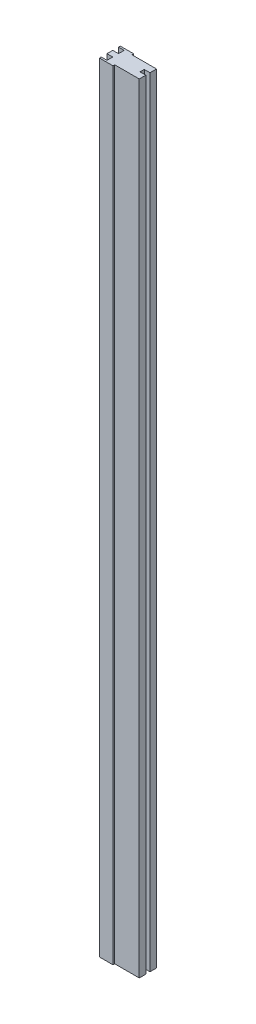
ISO-10303-21;
HEADER;
FILE_DESCRIPTION(('STEP AP214'),'2;1');
FILE_NAME('part.step','',(''),(''),'','','');
FILE_SCHEMA(('AUTOMOTIVE_DESIGN { 1 0 10303 214 1 1 1 1 }'));
ENDSEC;
DATA;
#1=APPLICATION_CONTEXT('core data for automotive mechanical design processes');
#2=APPLICATION_PROTOCOL_DEFINITION('international standard','automotive_design',2000,#1);
#3=PRODUCT_CONTEXT('',#1,'mechanical');
#4=PRODUCT('Part','Part','',(#3));
#5=PRODUCT_RELATED_PRODUCT_CATEGORY('part','',(#4));
#6=PRODUCT_DEFINITION_FORMATION('','',#4);
#7=PRODUCT_DEFINITION_CONTEXT('part definition',#1,'design');
#8=PRODUCT_DEFINITION('design','',#6,#7);
#9=PRODUCT_DEFINITION_SHAPE('','',#8);
#10=(LENGTH_UNIT() NAMED_UNIT(*) SI_UNIT(.MILLI.,.METRE.));
#11=(NAMED_UNIT(*) PLANE_ANGLE_UNIT() SI_UNIT($,.RADIAN.));
#12=(NAMED_UNIT(*) SI_UNIT($,.STERADIAN.) SOLID_ANGLE_UNIT());
#13=UNCERTAINTY_MEASURE_WITH_UNIT(LENGTH_MEASURE(1.E-05),#10,'distance_accuracy_value','');
#14=(GEOMETRIC_REPRESENTATION_CONTEXT(3) GLOBAL_UNCERTAINTY_ASSIGNED_CONTEXT((#13)) GLOBAL_UNIT_ASSIGNED_CONTEXT((#10,
#11,#12)) REPRESENTATION_CONTEXT('',''));
#15=CARTESIAN_POINT('',(0.,0.,0.));
#16=DIRECTION('',(0.,0.,1.));
#17=DIRECTION('',(1.,0.,0.));
#18=AXIS2_PLACEMENT_3D('',#15,#16,#17);
#19=CARTESIAN_POINT('',(3.34276045983517,1350.,-18.));
#20=DIRECTION('',(-1.,0.,0.));
#21=DIRECTION('',(0.,0.,1.));
#22=AXIS2_PLACEMENT_3D('',#19,#20,#21);
#23=PLANE('',#22);
#24=DIRECTION('',(0.,0.,-1.));
#25=VECTOR('',#24,1.);
#26=CARTESIAN_POINT('',(3.34276045983517,0.,-18.));
#27=LINE('',#26,#25);
#28=CARTESIAN_POINT('',(3.34276045983517,0.,-15.));
#29=VERTEX_POINT('',#28);
#30=CARTESIAN_POINT('',(3.34276045983517,0.,-18.));
#31=VERTEX_POINT('',#30);
#32=EDGE_CURVE('E201',#29,#31,#27,.T.);
#33=ORIENTED_EDGE('',*,*,#32,.T.);
#34=DIRECTION('',(0.,-1.,0.));
#35=VECTOR('',#34,1.);
#36=CARTESIAN_POINT('',(3.34276045983517,1350.,-18.));
#37=LINE('',#36,#35);
#38=CARTESIAN_POINT('',(3.34276045983517,1350.,-18.));
#39=VERTEX_POINT('',#38);
#40=EDGE_CURVE('E11',#39,#31,#37,.T.);
#41=ORIENTED_EDGE('',*,*,#40,.F.);
#42=DIRECTION('',(0.,0.,-1.));
#43=VECTOR('',#42,1.);
#44=CARTESIAN_POINT('',(3.34276045983517,1350.,-18.));
#45=LINE('',#44,#43);
#46=CARTESIAN_POINT('',(3.34276045983517,1350.,-15.));
#47=VERTEX_POINT('',#46);
#48=EDGE_CURVE('E240',#47,#39,#45,.T.);
#49=ORIENTED_EDGE('',*,*,#48,.F.);
#50=DIRECTION('',(0.,-1.,0.));
#51=VECTOR('',#50,1.);
#52=CARTESIAN_POINT('',(3.34276045983517,1350.,-15.));
#53=LINE('',#52,#51);
#54=EDGE_CURVE('E197',#47,#29,#53,.T.);
#55=ORIENTED_EDGE('',*,*,#54,.T.);
#56=EDGE_LOOP('',(#33,#41,#49,#55));
#57=FACE_BOUND('',#56,.T.);
#58=ADVANCED_FACE('F33',(#57),#23,.F.);
#59=CARTESIAN_POINT('',(-20.,1350.,-18.));
#60=DIRECTION('',(0.,0.,1.));
#61=DIRECTION('',(1.,0.,0.));
#62=AXIS2_PLACEMENT_3D('',#59,#60,#61);
#63=PLANE('',#62);
#64=DIRECTION('',(-1.,0.,0.));
#65=VECTOR('',#64,1.);
#66=CARTESIAN_POINT('',(-20.,0.,-18.));
#67=LINE('',#66,#65);
#68=CARTESIAN_POINT('',(-20.,0.,-18.));
#69=VERTEX_POINT('',#68);
#70=EDGE_CURVE('E204',#31,#69,#67,.T.);
#71=ORIENTED_EDGE('',*,*,#70,.T.);
#72=DIRECTION('',(0.,-1.,0.));
#73=VECTOR('',#72,1.);
#74=CARTESIAN_POINT('',(-20.,1350.,-18.));
#75=LINE('',#74,#73);
#76=CARTESIAN_POINT('',(-20.,1350.,-18.));
#77=VERTEX_POINT('',#76);
#78=EDGE_CURVE('E41',#77,#69,#75,.T.);
#79=ORIENTED_EDGE('',*,*,#78,.F.);
#80=DIRECTION('',(-1.,0.,0.));
#81=VECTOR('',#80,1.);
#82=CARTESIAN_POINT('',(-20.,1350.,-18.));
#83=LINE('',#82,#81);
#84=EDGE_CURVE('E128',#39,#77,#83,.T.);
#85=ORIENTED_EDGE('',*,*,#84,.F.);
#86=ORIENTED_EDGE('',*,*,#40,.T.);
#87=EDGE_LOOP('',(#71,#79,#85,#86));
#88=FACE_BOUND('',#87,.T.);
#89=ADVANCED_FACE('F358',(#88),#63,.F.);
#90=CARTESIAN_POINT('',(-20.,1350.,-14.9403088107532));
#91=DIRECTION('',(1.,0.,0.));
#92=DIRECTION('',(0.,0.,-1.));
#93=AXIS2_PLACEMENT_3D('',#90,#91,#92);
#94=PLANE('',#93);
#95=DIRECTION('',(0.,0.,1.));
#96=VECTOR('',#95,1.);
#97=CARTESIAN_POINT('',(-20.,0.,-14.9403088107532));
#98=LINE('',#97,#96);
#99=CARTESIAN_POINT('',(-20.,0.,-14.9403088107532));
#100=VERTEX_POINT('',#99);
#101=EDGE_CURVE('E206',#69,#100,#98,.T.);
#102=ORIENTED_EDGE('',*,*,#101,.T.);
#103=DIRECTION('',(0.,-1.,0.));
#104=VECTOR('',#103,1.);
#105=CARTESIAN_POINT('',(-20.,1350.,-14.9403088107532));
#106=LINE('',#105,#104);
#107=CARTESIAN_POINT('',(-20.,1350.,-14.9403088107532));
#108=VERTEX_POINT('',#107);
#109=EDGE_CURVE('E283',#108,#100,#106,.T.);
#110=ORIENTED_EDGE('',*,*,#109,.F.);
#111=DIRECTION('',(0.,0.,1.));
#112=VECTOR('',#111,1.);
#113=CARTESIAN_POINT('',(-20.,1350.,-14.9403088107532));
#114=LINE('',#113,#112);
#115=EDGE_CURVE('E291',#77,#108,#114,.T.);
#116=ORIENTED_EDGE('',*,*,#115,.F.);
#117=ORIENTED_EDGE('',*,*,#78,.T.);
#118=EDGE_LOOP('',(#102,#110,#116,#117));
#119=FACE_BOUND('',#118,.T.);
#120=ADVANCED_FACE('F289',(#119),#94,.F.);
#121=CARTESIAN_POINT('',(-10.,1350.,-14.9403088107532));
#122=DIRECTION('',(0.,0.,-1.));
#123=DIRECTION('',(-1.,0.,0.));
#124=AXIS2_PLACEMENT_3D('',#121,#122,#123);
#125=PLANE('',#124);
#126=DIRECTION('',(1.,0.,0.));
#127=VECTOR('',#126,1.);
#128=CARTESIAN_POINT('',(-10.,0.,-14.9403088107532));
#129=LINE('',#128,#127);
#130=CARTESIAN_POINT('',(-10.,0.,-14.9403088107532));
#131=VERTEX_POINT('',#130);
#132=EDGE_CURVE('E208',#100,#131,#129,.T.);
#133=ORIENTED_EDGE('',*,*,#132,.T.);
#134=DIRECTION('',(0.,-1.,0.));
#135=VECTOR('',#134,1.);
#136=CARTESIAN_POINT('',(-10.,1350.,-14.9403088107532));
#137=LINE('',#136,#135);
#138=CARTESIAN_POINT('',(-10.,1350.,-14.9403088107532));
#139=VERTEX_POINT('',#138);
#140=EDGE_CURVE('E280',#139,#131,#137,.T.);
#141=ORIENTED_EDGE('',*,*,#140,.F.);
#142=DIRECTION('',(1.,0.,0.));
#143=VECTOR('',#142,1.);
#144=CARTESIAN_POINT('',(-10.,1350.,-14.9403088107532));
#145=LINE('',#144,#143);
#146=EDGE_CURVE('E309',#108,#139,#145,.T.);
#147=ORIENTED_EDGE('',*,*,#146,.F.);
#148=ORIENTED_EDGE('',*,*,#109,.T.);
#149=EDGE_LOOP('',(#133,#141,#147,#148));
#150=FACE_BOUND('',#149,.T.);
#151=ADVANCED_FACE('F300',(#150),#125,.F.);
#152=CARTESIAN_POINT('',(-10.,1350.,-14.9403088107532));
#153=DIRECTION('',(1.,0.,0.));
#154=DIRECTION('',(0.,0.,-1.));
#155=AXIS2_PLACEMENT_3D('',#152,#153,#154);
#156=PLANE('',#155);
#157=DIRECTION('',(0.,0.,1.));
#158=VECTOR('',#157,1.);
#159=CARTESIAN_POINT('',(-10.,0.,-14.9403088107532));
#160=LINE('',#159,#158);
#161=CARTESIAN_POINT('',(-10.,0.,-5.));
#162=VERTEX_POINT('',#161);
#163=EDGE_CURVE('E210',#131,#162,#160,.T.);
#164=ORIENTED_EDGE('',*,*,#163,.T.);
#165=DIRECTION('',(0.,-1.,0.));
#166=VECTOR('',#165,1.);
#167=CARTESIAN_POINT('',(-10.,1350.,-5.));
#168=LINE('',#167,#166);
#169=CARTESIAN_POINT('',(-10.,1350.,-5.));
#170=VERTEX_POINT('',#169);
#171=EDGE_CURVE('E277',#170,#162,#168,.T.);
#172=ORIENTED_EDGE('',*,*,#171,.F.);
#173=DIRECTION('',(0.,0.,1.));
#174=VECTOR('',#173,1.);
#175=CARTESIAN_POINT('',(-10.,1350.,-14.9403088107532));
#176=LINE('',#175,#174);
#177=EDGE_CURVE('E306',#139,#170,#176,.T.);
#178=ORIENTED_EDGE('',*,*,#177,.F.);
#179=ORIENTED_EDGE('',*,*,#140,.T.);
#180=EDGE_LOOP('',(#164,#172,#178,#179));
#181=FACE_BOUND('',#180,.T.);
#182=ADVANCED_FACE('F304',(#181),#156,.F.);
#183=CARTESIAN_POINT('',(-10.,1350.,-5.));
#184=DIRECTION('',(0.,0.,1.));
#185=DIRECTION('',(1.,0.,0.));
#186=AXIS2_PLACEMENT_3D('',#183,#184,#185);
#187=PLANE('',#186);
#188=DIRECTION('',(-1.,0.,0.));
#189=VECTOR('',#188,1.);
#190=CARTESIAN_POINT('',(-10.,0.,-5.));
#191=LINE('',#190,#189);
#192=CARTESIAN_POINT('',(-20.,0.,-5.));
#193=VERTEX_POINT('',#192);
#194=EDGE_CURVE('E212',#162,#193,#191,.T.);
#195=ORIENTED_EDGE('',*,*,#194,.T.);
#196=DIRECTION('',(0.,-1.,0.));
#197=VECTOR('',#196,1.);
#198=CARTESIAN_POINT('',(-20.,1350.,-5.));
#199=LINE('',#198,#197);
#200=CARTESIAN_POINT('',(-20.,1350.,-5.));
#201=VERTEX_POINT('',#200);
#202=EDGE_CURVE('E274',#201,#193,#199,.T.);
#203=ORIENTED_EDGE('',*,*,#202,.F.);
#204=DIRECTION('',(-1.,0.,0.));
#205=VECTOR('',#204,1.);
#206=CARTESIAN_POINT('',(-10.,1350.,-5.));
#207=LINE('',#206,#205);
#208=EDGE_CURVE('E308',#170,#201,#207,.T.);
#209=ORIENTED_EDGE('',*,*,#208,.F.);
#210=ORIENTED_EDGE('',*,*,#171,.T.);
#211=EDGE_LOOP('',(#195,#203,#209,#210));
#212=FACE_BOUND('',#211,.T.);
#213=ADVANCED_FACE('F371',(#212),#187,.F.);
#214=CARTESIAN_POINT('',(-20.,1350.,5.));
#215=DIRECTION('',(1.,0.,0.));
#216=DIRECTION('',(0.,0.,-1.));
#217=AXIS2_PLACEMENT_3D('',#214,#215,#216);
#218=PLANE('',#217);
#219=DIRECTION('',(0.,0.,1.));
#220=VECTOR('',#219,1.);
#221=CARTESIAN_POINT('',(-20.,0.,5.));
#222=LINE('',#221,#220);
#223=CARTESIAN_POINT('',(-20.,0.,5.));
#224=VERTEX_POINT('',#223);
#225=EDGE_CURVE('E215',#193,#224,#222,.T.);
#226=ORIENTED_EDGE('',*,*,#225,.T.);
#227=DIRECTION('',(0.,-1.,0.));
#228=VECTOR('',#227,1.);
#229=CARTESIAN_POINT('',(-20.,1350.,5.));
#230=LINE('',#229,#228);
#231=CARTESIAN_POINT('',(-20.,1350.,5.));
#232=VERTEX_POINT('',#231);
#233=EDGE_CURVE('E271',#232,#224,#230,.T.);
#234=ORIENTED_EDGE('',*,*,#233,.F.);
#235=DIRECTION('',(0.,0.,1.));
#236=VECTOR('',#235,1.);
#237=CARTESIAN_POINT('',(-20.,1350.,-5.));
#238=LINE('',#237,#236);
#239=EDGE_CURVE('E311',#201,#232,#238,.T.);
#240=ORIENTED_EDGE('',*,*,#239,.F.);
#241=ORIENTED_EDGE('',*,*,#202,.T.);
#242=EDGE_LOOP('',(#226,#234,#240,#241));
#243=FACE_BOUND('',#242,.T.);
#244=ADVANCED_FACE('F374',(#243),#218,.F.);
#245=CARTESIAN_POINT('',(-10.,1350.,5.));
#246=DIRECTION('',(0.,0.,-1.));
#247=DIRECTION('',(-1.,0.,0.));
#248=AXIS2_PLACEMENT_3D('',#245,#246,#247);
#249=PLANE('',#248);
#250=DIRECTION('',(1.,0.,0.));
#251=VECTOR('',#250,1.);
#252=CARTESIAN_POINT('',(-10.,0.,5.));
#253=LINE('',#252,#251);
#254=CARTESIAN_POINT('',(-10.,0.,5.));
#255=VERTEX_POINT('',#254);
#256=EDGE_CURVE('E217',#224,#255,#253,.T.);
#257=ORIENTED_EDGE('',*,*,#256,.T.);
#258=DIRECTION('',(0.,-1.,0.));
#259=VECTOR('',#258,1.);
#260=CARTESIAN_POINT('',(-10.,1350.,5.));
#261=LINE('',#260,#259);
#262=CARTESIAN_POINT('',(-10.,1350.,5.));
#263=VERTEX_POINT('',#262);
#264=EDGE_CURVE('E268',#263,#255,#261,.T.);
#265=ORIENTED_EDGE('',*,*,#264,.F.);
#266=DIRECTION('',(1.,0.,0.));
#267=VECTOR('',#266,1.);
#268=CARTESIAN_POINT('',(-10.,1350.,5.));
#269=LINE('',#268,#267);
#270=EDGE_CURVE('E317',#232,#263,#269,.T.);
#271=ORIENTED_EDGE('',*,*,#270,.F.);
#272=ORIENTED_EDGE('',*,*,#233,.T.);
#273=EDGE_LOOP('',(#257,#265,#271,#272));
#274=FACE_BOUND('',#273,.T.);
#275=ADVANCED_FACE('F378',(#274),#249,.F.);
#276=CARTESIAN_POINT('',(-10.,1350.,14.9403088107532));
#277=DIRECTION('',(1.,0.,0.));
#278=DIRECTION('',(0.,0.,-1.));
#279=AXIS2_PLACEMENT_3D('',#276,#277,#278);
#280=PLANE('',#279);
#281=DIRECTION('',(0.,0.,1.));
#282=VECTOR('',#281,1.);
#283=CARTESIAN_POINT('',(-10.,0.,14.9403088107532));
#284=LINE('',#283,#282);
#285=CARTESIAN_POINT('',(-10.,0.,14.9403088107532));
#286=VERTEX_POINT('',#285);
#287=EDGE_CURVE('E219',#255,#286,#284,.T.);
#288=ORIENTED_EDGE('',*,*,#287,.T.);
#289=DIRECTION('',(0.,-1.,0.));
#290=VECTOR('',#289,1.);
#291=CARTESIAN_POINT('',(-10.,1350.,14.9403088107532));
#292=LINE('',#291,#290);
#293=CARTESIAN_POINT('',(-10.,1350.,14.9403088107532));
#294=VERTEX_POINT('',#293);
#295=EDGE_CURVE('E265',#294,#286,#292,.T.);
#296=ORIENTED_EDGE('',*,*,#295,.F.);
#297=DIRECTION('',(0.,0.,1.));
#298=VECTOR('',#297,1.);
#299=CARTESIAN_POINT('',(-10.,1350.,14.9403088107532));
#300=LINE('',#299,#298);
#301=EDGE_CURVE('E319',#263,#294,#300,.T.);
#302=ORIENTED_EDGE('',*,*,#301,.F.);
#303=ORIENTED_EDGE('',*,*,#264,.T.);
#304=EDGE_LOOP('',(#288,#296,#302,#303));
#305=FACE_BOUND('',#304,.T.);
#306=ADVANCED_FACE('F382',(#305),#280,.F.);
#307=CARTESIAN_POINT('',(-10.,1350.,14.9403088107532));
#308=DIRECTION('',(0.,0.,1.));
#309=DIRECTION('',(1.,0.,0.));
#310=AXIS2_PLACEMENT_3D('',#307,#308,#309);
#311=PLANE('',#310);
#312=DIRECTION('',(-1.,0.,0.));
#313=VECTOR('',#312,1.);
#314=CARTESIAN_POINT('',(-10.,0.,14.9403088107532));
#315=LINE('',#314,#313);
#316=CARTESIAN_POINT('',(-20.,0.,14.9403088107532));
#317=VERTEX_POINT('',#316);
#318=EDGE_CURVE('E221',#286,#317,#315,.T.);
#319=ORIENTED_EDGE('',*,*,#318,.T.);
#320=DIRECTION('',(0.,-1.,0.));
#321=VECTOR('',#320,1.);
#322=CARTESIAN_POINT('',(-20.,1350.,14.9403088107532));
#323=LINE('',#322,#321);
#324=CARTESIAN_POINT('',(-20.,1350.,14.9403088107532));
#325=VERTEX_POINT('',#324);
#326=EDGE_CURVE('E262',#325,#317,#323,.T.);
#327=ORIENTED_EDGE('',*,*,#326,.F.);
#328=DIRECTION('',(-1.,0.,0.));
#329=VECTOR('',#328,1.);
#330=CARTESIAN_POINT('',(-10.,1350.,14.9403088107532));
#331=LINE('',#330,#329);
#332=EDGE_CURVE('E321',#294,#325,#331,.T.);
#333=ORIENTED_EDGE('',*,*,#332,.F.);
#334=ORIENTED_EDGE('',*,*,#295,.T.);
#335=EDGE_LOOP('',(#319,#327,#333,#334));
#336=FACE_BOUND('',#335,.T.);
#337=ADVANCED_FACE('F386',(#336),#311,.F.);
#338=CARTESIAN_POINT('',(-20.,1350.,14.9403088107532));
#339=DIRECTION('',(1.,0.,0.));
#340=DIRECTION('',(0.,0.,-1.));
#341=AXIS2_PLACEMENT_3D('',#338,#339,#340);
#342=PLANE('',#341);
#343=DIRECTION('',(0.,0.,1.));
#344=VECTOR('',#343,1.);
#345=CARTESIAN_POINT('',(-20.,0.,14.9403088107532));
#346=LINE('',#345,#344);
#347=CARTESIAN_POINT('',(-20.,0.,18.));
#348=VERTEX_POINT('',#347);
#349=EDGE_CURVE('E223',#317,#348,#346,.T.);
#350=ORIENTED_EDGE('',*,*,#349,.T.);
#351=DIRECTION('',(0.,-1.,0.));
#352=VECTOR('',#351,1.);
#353=CARTESIAN_POINT('',(-20.,1350.,18.));
#354=LINE('',#353,#352);
#355=CARTESIAN_POINT('',(-20.,1350.,18.));
#356=VERTEX_POINT('',#355);
#357=EDGE_CURVE('E259',#356,#348,#354,.T.);
#358=ORIENTED_EDGE('',*,*,#357,.F.);
#359=DIRECTION('',(0.,0.,1.));
#360=VECTOR('',#359,1.);
#361=CARTESIAN_POINT('',(-20.,1350.,14.9403088107532));
#362=LINE('',#361,#360);
#363=EDGE_CURVE('E323',#325,#356,#362,.T.);
#364=ORIENTED_EDGE('',*,*,#363,.F.);
#365=ORIENTED_EDGE('',*,*,#326,.T.);
#366=EDGE_LOOP('',(#350,#358,#364,#365));
#367=FACE_BOUND('',#366,.T.);
#368=ADVANCED_FACE('F390',(#367),#342,.F.);
#369=CARTESIAN_POINT('',(-20.,1350.,18.));
#370=DIRECTION('',(0.,0.,-1.));
#371=DIRECTION('',(-1.,0.,0.));
#372=AXIS2_PLACEMENT_3D('',#369,#370,#371);
#373=PLANE('',#372);
#374=DIRECTION('',(1.,0.,0.));
#375=VECTOR('',#374,1.);
#376=CARTESIAN_POINT('',(-20.,0.,18.));
#377=LINE('',#376,#375);
#378=CARTESIAN_POINT('',(3.34276045983517,0.,18.));
#379=VERTEX_POINT('',#378);
#380=EDGE_CURVE('E225',#348,#379,#377,.T.);
#381=ORIENTED_EDGE('',*,*,#380,.T.);
#382=DIRECTION('',(0.,-1.,0.));
#383=VECTOR('',#382,1.);
#384=CARTESIAN_POINT('',(3.34276045983517,1350.,18.));
#385=LINE('',#384,#383);
#386=CARTESIAN_POINT('',(3.34276045983517,1350.,18.));
#387=VERTEX_POINT('',#386);
#388=EDGE_CURVE('E256',#387,#379,#385,.T.);
#389=ORIENTED_EDGE('',*,*,#388,.F.);
#390=DIRECTION('',(1.,0.,0.));
#391=VECTOR('',#390,1.);
#392=CARTESIAN_POINT('',(-20.,1350.,18.));
#393=LINE('',#392,#391);
#394=EDGE_CURVE('E325',#356,#387,#393,.T.);
#395=ORIENTED_EDGE('',*,*,#394,.F.);
#396=ORIENTED_EDGE('',*,*,#357,.T.);
#397=EDGE_LOOP('',(#381,#389,#395,#396));
#398=FACE_BOUND('',#397,.T.);
#399=ADVANCED_FACE('F394',(#398),#373,.F.);
#400=CARTESIAN_POINT('',(3.34276045983517,1350.,18.));
#401=DIRECTION('',(-1.,0.,0.));
#402=DIRECTION('',(0.,0.,1.));
#403=AXIS2_PLACEMENT_3D('',#400,#401,#402);
#404=PLANE('',#403);
#405=DIRECTION('',(0.,0.,-1.));
#406=VECTOR('',#405,1.);
#407=CARTESIAN_POINT('',(3.34276045983517,0.,18.));
#408=LINE('',#407,#406);
#409=CARTESIAN_POINT('',(3.34276045983517,0.,15.));
#410=VERTEX_POINT('',#409);
#411=EDGE_CURVE('E227',#379,#410,#408,.T.);
#412=ORIENTED_EDGE('',*,*,#411,.T.);
#413=DIRECTION('',(0.,-1.,0.));
#414=VECTOR('',#413,1.);
#415=CARTESIAN_POINT('',(3.34276045983517,1350.,15.));
#416=LINE('',#415,#414);
#417=CARTESIAN_POINT('',(3.34276045983517,1350.,15.));
#418=VERTEX_POINT('',#417);
#419=EDGE_CURVE('E253',#418,#410,#416,.T.);
#420=ORIENTED_EDGE('',*,*,#419,.F.);
#421=DIRECTION('',(0.,0.,-1.));
#422=VECTOR('',#421,1.);
#423=CARTESIAN_POINT('',(3.34276045983517,1350.,18.));
#424=LINE('',#423,#422);
#425=EDGE_CURVE('E327',#387,#418,#424,.T.);
#426=ORIENTED_EDGE('',*,*,#425,.F.);
#427=ORIENTED_EDGE('',*,*,#388,.T.);
#428=EDGE_LOOP('',(#412,#420,#426,#427));
#429=FACE_BOUND('',#428,.T.);
#430=ADVANCED_FACE('F398',(#429),#404,.F.);
#431=CARTESIAN_POINT('',(3.34276045983517,1350.,15.));
#432=DIRECTION('',(0.,0.,-1.));
#433=DIRECTION('',(-1.,0.,0.));
#434=AXIS2_PLACEMENT_3D('',#431,#432,#433);
#435=PLANE('',#434);
#436=DIRECTION('',(1.,0.,0.));
#437=VECTOR('',#436,1.);
#438=CARTESIAN_POINT('',(3.34276045983517,0.,15.));
#439=LINE('',#438,#437);
#440=CARTESIAN_POINT('',(46.,0.,15.));
#441=VERTEX_POINT('',#440);
#442=EDGE_CURVE('E229',#410,#441,#439,.T.);
#443=ORIENTED_EDGE('',*,*,#442,.T.);
#444=DIRECTION('',(0.,-1.,0.));
#445=VECTOR('',#444,1.);
#446=CARTESIAN_POINT('',(46.,1350.,15.));
#447=LINE('',#446,#445);
#448=CARTESIAN_POINT('',(46.,1350.,15.));
#449=VERTEX_POINT('',#448);
#450=EDGE_CURVE('E250',#449,#441,#447,.T.);
#451=ORIENTED_EDGE('',*,*,#450,.F.);
#452=DIRECTION('',(1.,0.,0.));
#453=VECTOR('',#452,1.);
#454=CARTESIAN_POINT('',(3.34276045983517,1350.,15.));
#455=LINE('',#454,#453);
#456=EDGE_CURVE('E329',#418,#449,#455,.T.);
#457=ORIENTED_EDGE('',*,*,#456,.F.);
#458=ORIENTED_EDGE('',*,*,#419,.T.);
#459=EDGE_LOOP('',(#443,#451,#457,#458));
#460=FACE_BOUND('',#459,.T.);
#461=ADVANCED_FACE('F402',(#460),#435,.F.);
#462=CARTESIAN_POINT('',(46.,1350.,15.));
#463=DIRECTION('',(-1.,0.,0.));
#464=DIRECTION('',(0.,0.,1.));
#465=AXIS2_PLACEMENT_3D('',#462,#463,#464);
#466=PLANE('',#465);
#467=DIRECTION('',(0.,0.,-1.));
#468=VECTOR('',#467,1.);
#469=CARTESIAN_POINT('',(46.,0.,15.));
#470=LINE('',#469,#468);
#471=CARTESIAN_POINT('',(46.,0.,3.68553336557679));
#472=VERTEX_POINT('',#471);
#473=EDGE_CURVE('E231',#441,#472,#470,.T.);
#474=ORIENTED_EDGE('',*,*,#473,.T.);
#475=DIRECTION('',(0.,-1.,0.));
#476=VECTOR('',#475,1.);
#477=CARTESIAN_POINT('',(46.,1350.,3.68553336557679));
#478=LINE('',#477,#476);
#479=CARTESIAN_POINT('',(46.,1350.,3.68553336557679));
#480=VERTEX_POINT('',#479);
#481=EDGE_CURVE('E247',#480,#472,#478,.T.);
#482=ORIENTED_EDGE('',*,*,#481,.F.);
#483=DIRECTION('',(0.,0.,-1.));
#484=VECTOR('',#483,1.);
#485=CARTESIAN_POINT('',(46.,1350.,15.));
#486=LINE('',#485,#484);
#487=EDGE_CURVE('E331',#449,#480,#486,.T.);
#488=ORIENTED_EDGE('',*,*,#487,.F.);
#489=ORIENTED_EDGE('',*,*,#450,.T.);
#490=EDGE_LOOP('',(#474,#482,#488,#489));
#491=FACE_BOUND('',#490,.T.);
#492=ADVANCED_FACE('F406',(#491),#466,.F.);
#493=CARTESIAN_POINT('',(46.,1350.,3.68553336557679));
#494=DIRECTION('',(0.,0.,1.));
#495=DIRECTION('',(1.,0.,0.));
#496=AXIS2_PLACEMENT_3D('',#493,#494,#495);
#497=PLANE('',#496);
#498=DIRECTION('',(-1.,0.,0.));
#499=VECTOR('',#498,1.);
#500=CARTESIAN_POINT('',(46.,0.,3.68553336557679));
#501=LINE('',#500,#499);
#502=CARTESIAN_POINT('',(36.,0.,3.68553336557679));
#503=VERTEX_POINT('',#502);
#504=EDGE_CURVE('E233',#472,#503,#501,.T.);
#505=ORIENTED_EDGE('',*,*,#504,.T.);
#506=DIRECTION('',(0.,-1.,0.));
#507=VECTOR('',#506,1.);
#508=CARTESIAN_POINT('',(36.,1350.,3.68553336557679));
#509=LINE('',#508,#507);
#510=CARTESIAN_POINT('',(36.,1350.,3.68553336557679));
#511=VERTEX_POINT('',#510);
#512=EDGE_CURVE('E244',#511,#503,#509,.T.);
#513=ORIENTED_EDGE('',*,*,#512,.F.);
#514=DIRECTION('',(-1.,0.,0.));
#515=VECTOR('',#514,1.);
#516=CARTESIAN_POINT('',(46.,1350.,3.68553336557679));
#517=LINE('',#516,#515);
#518=EDGE_CURVE('E333',#480,#511,#517,.T.);
#519=ORIENTED_EDGE('',*,*,#518,.F.);
#520=ORIENTED_EDGE('',*,*,#481,.T.);
#521=EDGE_LOOP('',(#505,#513,#519,#520));
#522=FACE_BOUND('',#521,.T.);
#523=ADVANCED_FACE('F339',(#522),#497,.F.);
#524=CARTESIAN_POINT('',(36.,1350.,3.68553336557679));
#525=DIRECTION('',(-1.,0.,0.));
#526=DIRECTION('',(0.,0.,1.));
#527=AXIS2_PLACEMENT_3D('',#524,#525,#526);
#528=PLANE('',#527);
#529=DIRECTION('',(0.,0.,-1.));
#530=VECTOR('',#529,1.);
#531=CARTESIAN_POINT('',(36.,0.,3.68553336557679));
#532=LINE('',#531,#530);
#533=CARTESIAN_POINT('',(36.,0.,-3.68553336557679));
#534=VERTEX_POINT('',#533);
#535=EDGE_CURVE('E235',#503,#534,#532,.T.);
#536=ORIENTED_EDGE('',*,*,#535,.T.);
#537=DIRECTION('',(0.,-1.,0.));
#538=VECTOR('',#537,1.);
#539=CARTESIAN_POINT('',(36.,1350.,-3.68553336557679));
#540=LINE('',#539,#538);
#541=CARTESIAN_POINT('',(36.,1350.,-3.68553336557679));
#542=VERTEX_POINT('',#541);
#543=EDGE_CURVE('E192',#542,#534,#540,.T.);
#544=ORIENTED_EDGE('',*,*,#543,.F.);
#545=DIRECTION('',(0.,0.,-1.));
#546=VECTOR('',#545,1.);
#547=CARTESIAN_POINT('',(36.,1350.,3.68553336557679));
#548=LINE('',#547,#546);
#549=EDGE_CURVE('E183',#511,#542,#548,.T.);
#550=ORIENTED_EDGE('',*,*,#549,.F.);
#551=ORIENTED_EDGE('',*,*,#512,.T.);
#552=EDGE_LOOP('',(#536,#544,#550,#551));
#553=FACE_BOUND('',#552,.T.);
#554=ADVANCED_FACE('F343',(#553),#528,.F.);
#555=CARTESIAN_POINT('',(46.,1350.,-3.68553336557679));
#556=DIRECTION('',(0.,0.,-1.));
#557=DIRECTION('',(-1.,0.,0.));
#558=AXIS2_PLACEMENT_3D('',#555,#556,#557);
#559=PLANE('',#558);
#560=DIRECTION('',(1.,0.,0.));
#561=VECTOR('',#560,1.);
#562=CARTESIAN_POINT('',(46.,0.,-3.68553336557679));
#563=LINE('',#562,#561);
#564=CARTESIAN_POINT('',(46.,0.,-3.68553336557679));
#565=VERTEX_POINT('',#564);
#566=EDGE_CURVE('E191',#534,#565,#563,.T.);
#567=ORIENTED_EDGE('',*,*,#566,.T.);
#568=DIRECTION('',(0.,-1.,0.));
#569=VECTOR('',#568,1.);
#570=CARTESIAN_POINT('',(46.,1350.,-3.68553336557679));
#571=LINE('',#570,#569);
#572=CARTESIAN_POINT('',(46.,1350.,-3.68553336557679));
#573=VERTEX_POINT('',#572);
#574=EDGE_CURVE('E188',#573,#565,#571,.T.);
#575=ORIENTED_EDGE('',*,*,#574,.F.);
#576=DIRECTION('',(1.,0.,0.));
#577=VECTOR('',#576,1.);
#578=CARTESIAN_POINT('',(46.,1350.,-3.68553336557679));
#579=LINE('',#578,#577);
#580=EDGE_CURVE('E177',#542,#573,#579,.T.);
#581=ORIENTED_EDGE('',*,*,#580,.F.);
#582=ORIENTED_EDGE('',*,*,#543,.T.);
#583=EDGE_LOOP('',(#567,#575,#581,#582));
#584=FACE_BOUND('',#583,.T.);
#585=ADVANCED_FACE('F189',(#584),#559,.F.);
#586=CARTESIAN_POINT('',(46.,1350.,-15.));
#587=DIRECTION('',(-1.,0.,0.));
#588=DIRECTION('',(0.,0.,1.));
#589=AXIS2_PLACEMENT_3D('',#586,#587,#588);
#590=PLANE('',#589);
#591=DIRECTION('',(0.,0.,-1.));
#592=VECTOR('',#591,1.);
#593=CARTESIAN_POINT('',(46.,0.,-15.));
#594=LINE('',#593,#592);
#595=CARTESIAN_POINT('',(46.,0.,-15.));
#596=VERTEX_POINT('',#595);
#597=EDGE_CURVE('E114',#565,#596,#594,.T.);
#598=ORIENTED_EDGE('',*,*,#597,.T.);
#599=DIRECTION('',(0.,-1.,0.));
#600=VECTOR('',#599,1.);
#601=CARTESIAN_POINT('',(46.,1350.,-15.));
#602=LINE('',#601,#600);
#603=CARTESIAN_POINT('',(46.,1350.,-15.));
#604=VERTEX_POINT('',#603);
#605=EDGE_CURVE('E193',#604,#596,#602,.T.);
#606=ORIENTED_EDGE('',*,*,#605,.F.);
#607=DIRECTION('',(0.,0.,-1.));
#608=VECTOR('',#607,1.);
#609=CARTESIAN_POINT('',(46.,1350.,-15.));
#610=LINE('',#609,#608);
#611=EDGE_CURVE('E181',#573,#604,#610,.T.);
#612=ORIENTED_EDGE('',*,*,#611,.F.);
#613=ORIENTED_EDGE('',*,*,#574,.T.);
#614=EDGE_LOOP('',(#598,#606,#612,#613));
#615=FACE_BOUND('',#614,.T.);
#616=ADVANCED_FACE('F195',(#615),#590,.F.);
#617=CARTESIAN_POINT('',(3.34276045983517,1350.,-15.));
#618=DIRECTION('',(0.,0.,1.));
#619=DIRECTION('',(1.,0.,0.));
#620=AXIS2_PLACEMENT_3D('',#617,#618,#619);
#621=PLANE('',#620);
#622=DIRECTION('',(-1.,0.,0.));
#623=VECTOR('',#622,1.);
#624=CARTESIAN_POINT('',(3.34276045983517,0.,-15.));
#625=LINE('',#624,#623);
#626=EDGE_CURVE('E120',#596,#29,#625,.T.);
#627=ORIENTED_EDGE('',*,*,#626,.T.);
#628=ORIENTED_EDGE('',*,*,#54,.F.);
#629=DIRECTION('',(-1.,0.,0.));
#630=VECTOR('',#629,1.);
#631=CARTESIAN_POINT('',(3.34276045983517,1350.,-15.));
#632=LINE('',#631,#630);
#633=EDGE_CURVE('E49',#604,#47,#632,.T.);
#634=ORIENTED_EDGE('',*,*,#633,.F.);
#635=ORIENTED_EDGE('',*,*,#605,.T.);
#636=EDGE_LOOP('',(#627,#628,#634,#635));
#637=FACE_BOUND('',#636,.T.);
#638=ADVANCED_FACE('F347',(#637),#621,.F.);
#639=CARTESIAN_POINT('',(0.,1350.,0.));
#640=DIRECTION('',(0.,1.,0.));
#641=DIRECTION('',(0.,0.,1.));
#642=AXIS2_PLACEMENT_3D('',#639,#640,#641);
#643=PLANE('',#642);
#644=ORIENTED_EDGE('',*,*,#48,.T.);
#645=ORIENTED_EDGE('',*,*,#84,.T.);
#646=ORIENTED_EDGE('',*,*,#115,.T.);
#647=ORIENTED_EDGE('',*,*,#146,.T.);
#648=ORIENTED_EDGE('',*,*,#177,.T.);
#649=ORIENTED_EDGE('',*,*,#208,.T.);
#650=ORIENTED_EDGE('',*,*,#239,.T.);
#651=ORIENTED_EDGE('',*,*,#270,.T.);
#652=ORIENTED_EDGE('',*,*,#301,.T.);
#653=ORIENTED_EDGE('',*,*,#332,.T.);
#654=ORIENTED_EDGE('',*,*,#363,.T.);
#655=ORIENTED_EDGE('',*,*,#394,.T.);
#656=ORIENTED_EDGE('',*,*,#425,.T.);
#657=ORIENTED_EDGE('',*,*,#456,.T.);
#658=ORIENTED_EDGE('',*,*,#487,.T.);
#659=ORIENTED_EDGE('',*,*,#518,.T.);
#660=ORIENTED_EDGE('',*,*,#549,.T.);
#661=ORIENTED_EDGE('',*,*,#580,.T.);
#662=ORIENTED_EDGE('',*,*,#611,.T.);
#663=ORIENTED_EDGE('',*,*,#633,.T.);
#664=EDGE_LOOP('',(#644,#645,#646,#647,#648,#649,#650,#651,#652,#653,#654,#655,#656,#657,#658,
#659,#660,#661,#662,#663));
#665=FACE_BOUND('',#664,.T.);
#666=ADVANCED_FACE('F179',(#665),#643,.T.);
#667=CARTESIAN_POINT('',(0.,0.,0.));
#668=DIRECTION('',(0.,1.,0.));
#669=DIRECTION('',(0.,0.,1.));
#670=AXIS2_PLACEMENT_3D('',#667,#668,#669);
#671=PLANE('',#670);
#672=ORIENTED_EDGE('',*,*,#32,.F.);
#673=ORIENTED_EDGE('',*,*,#626,.F.);
#674=ORIENTED_EDGE('',*,*,#597,.F.);
#675=ORIENTED_EDGE('',*,*,#566,.F.);
#676=ORIENTED_EDGE('',*,*,#535,.F.);
#677=ORIENTED_EDGE('',*,*,#504,.F.);
#678=ORIENTED_EDGE('',*,*,#473,.F.);
#679=ORIENTED_EDGE('',*,*,#442,.F.);
#680=ORIENTED_EDGE('',*,*,#411,.F.);
#681=ORIENTED_EDGE('',*,*,#380,.F.);
#682=ORIENTED_EDGE('',*,*,#349,.F.);
#683=ORIENTED_EDGE('',*,*,#318,.F.);
#684=ORIENTED_EDGE('',*,*,#287,.F.);
#685=ORIENTED_EDGE('',*,*,#256,.F.);
#686=ORIENTED_EDGE('',*,*,#225,.F.);
#687=ORIENTED_EDGE('',*,*,#194,.F.);
#688=ORIENTED_EDGE('',*,*,#163,.F.);
#689=ORIENTED_EDGE('',*,*,#132,.F.);
#690=ORIENTED_EDGE('',*,*,#101,.F.);
#691=ORIENTED_EDGE('',*,*,#70,.F.);
#692=EDGE_LOOP('',(#672,#673,#674,#675,#676,#677,#678,#679,#680,#681,#682,#683,#684,#685,#686,
#687,#688,#689,#690,#691));
#693=FACE_BOUND('',#692,.T.);
#694=ADVANCED_FACE('F295',(#693),#671,.F.);
#695=CLOSED_SHELL('',(#58,#89,#120,#151,#182,#213,#244,#275,#306,#337,#368,#399,#430,#461,#492,
#523,#554,#585,#616,#638,#666,#694));
#696=MANIFOLD_SOLID_BREP('B2',#695);
#697=ADVANCED_BREP_SHAPE_REPRESENTATION('',(#18,#696),#14);
#698=SHAPE_DEFINITION_REPRESENTATION(#9,#697);
ENDSEC;
END-ISO-10303-21;
